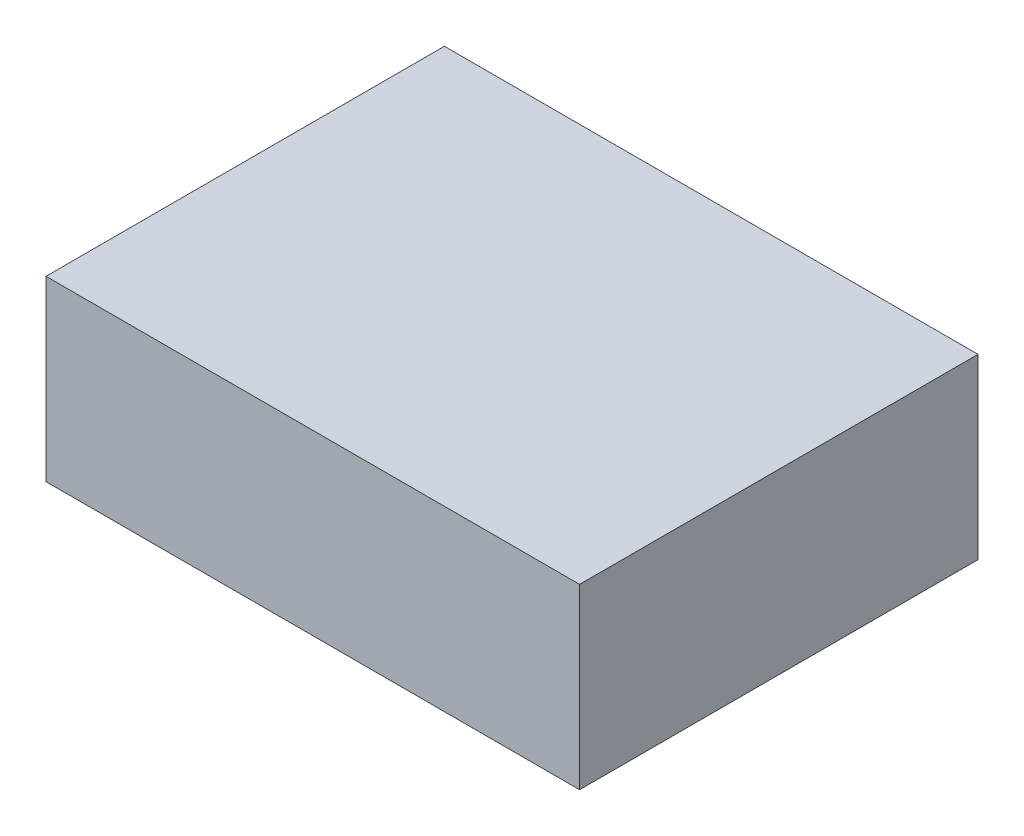
ISO-10303-21;
HEADER;
FILE_DESCRIPTION(('STEP AP214'),'2;1');
FILE_NAME('part.step','',(''),(''),'','','');
FILE_SCHEMA(('AUTOMOTIVE_DESIGN { 1 0 10303 214 1 1 1 1 }'));
ENDSEC;
DATA;
#1=APPLICATION_CONTEXT('core data for automotive mechanical design processes');
#2=APPLICATION_PROTOCOL_DEFINITION('international standard','automotive_design',2000,#1);
#3=PRODUCT_CONTEXT('',#1,'mechanical');
#4=PRODUCT('Part','Part','',(#3));
#5=PRODUCT_RELATED_PRODUCT_CATEGORY('part','',(#4));
#6=PRODUCT_DEFINITION_FORMATION('','',#4);
#7=PRODUCT_DEFINITION_CONTEXT('part definition',#1,'design');
#8=PRODUCT_DEFINITION('design','',#6,#7);
#9=PRODUCT_DEFINITION_SHAPE('','',#8);
#10=(LENGTH_UNIT() NAMED_UNIT(*) SI_UNIT(.MILLI.,.METRE.));
#11=(NAMED_UNIT(*) PLANE_ANGLE_UNIT() SI_UNIT($,.RADIAN.));
#12=(NAMED_UNIT(*) SI_UNIT($,.STERADIAN.) SOLID_ANGLE_UNIT());
#13=UNCERTAINTY_MEASURE_WITH_UNIT(LENGTH_MEASURE(1.E-05),#10,'distance_accuracy_value','');
#14=(GEOMETRIC_REPRESENTATION_CONTEXT(3) GLOBAL_UNCERTAINTY_ASSIGNED_CONTEXT((#13)) GLOBAL_UNIT_ASSIGNED_CONTEXT((#10,
#11,#12)) REPRESENTATION_CONTEXT('',''));
#15=CARTESIAN_POINT('',(0.,0.,0.));
#16=DIRECTION('',(0.,0.,1.));
#17=DIRECTION('',(1.,0.,0.));
#18=AXIS2_PLACEMENT_3D('',#15,#16,#17);
#19=CARTESIAN_POINT('',(0.,31.75,0.));
#20=DIRECTION('',(1.,0.,0.));
#21=DIRECTION('',(0.,0.,-1.));
#22=AXIS2_PLACEMENT_3D('',#19,#20,#21);
#23=PLANE('',#22);
#24=DIRECTION('',(0.,0.,1.));
#25=VECTOR('',#24,1.);
#26=CARTESIAN_POINT('',(0.,0.,0.));
#27=LINE('',#26,#25);
#28=CARTESIAN_POINT('',(0.,0.,-71.12));
#29=VERTEX_POINT('',#28);
#30=CARTESIAN_POINT('',(0.,0.,0.));
#31=VERTEX_POINT('',#30);
#32=EDGE_CURVE('E102',#29,#31,#27,.T.);
#33=ORIENTED_EDGE('',*,*,#32,.T.);
#34=DIRECTION('',(0.,-1.,0.));
#35=VECTOR('',#34,1.);
#36=CARTESIAN_POINT('',(0.,31.75,0.));
#37=LINE('',#36,#35);
#38=CARTESIAN_POINT('',(0.,31.75,0.));
#39=VERTEX_POINT('',#38);
#40=EDGE_CURVE('E11',#39,#31,#37,.T.);
#41=ORIENTED_EDGE('',*,*,#40,.F.);
#42=DIRECTION('',(0.,0.,1.));
#43=VECTOR('',#42,1.);
#44=CARTESIAN_POINT('',(0.,31.75,0.));
#45=LINE('',#44,#43);
#46=CARTESIAN_POINT('',(0.,31.75,-71.12));
#47=VERTEX_POINT('',#46);
#48=EDGE_CURVE('E90',#47,#39,#45,.T.);
#49=ORIENTED_EDGE('',*,*,#48,.F.);
#50=DIRECTION('',(0.,-1.,0.));
#51=VECTOR('',#50,1.);
#52=CARTESIAN_POINT('',(0.,31.75,-71.12));
#53=LINE('',#52,#51);
#54=EDGE_CURVE('E98',#47,#29,#53,.T.);
#55=ORIENTED_EDGE('',*,*,#54,.T.);
#56=EDGE_LOOP('',(#33,#41,#49,#55));
#57=FACE_BOUND('',#56,.T.);
#58=ADVANCED_FACE('F39',(#57),#23,.F.);
#59=CARTESIAN_POINT('',(0.,31.75,0.));
#60=DIRECTION('',(0.,0.,-1.));
#61=DIRECTION('',(-1.,0.,0.));
#62=AXIS2_PLACEMENT_3D('',#59,#60,#61);
#63=PLANE('',#62);
#64=DIRECTION('',(1.,0.,0.));
#65=VECTOR('',#64,1.);
#66=CARTESIAN_POINT('',(0.,0.,0.));
#67=LINE('',#66,#65);
#68=CARTESIAN_POINT('',(95.25,0.,0.));
#69=VERTEX_POINT('',#68);
#70=EDGE_CURVE('E94',#31,#69,#67,.T.);
#71=ORIENTED_EDGE('',*,*,#70,.T.);
#72=DIRECTION('',(0.,-1.,0.));
#73=VECTOR('',#72,1.);
#74=CARTESIAN_POINT('',(95.25,31.75,0.));
#75=LINE('',#74,#73);
#76=CARTESIAN_POINT('',(95.25,31.75,0.));
#77=VERTEX_POINT('',#76);
#78=EDGE_CURVE('E47',#77,#69,#75,.T.);
#79=ORIENTED_EDGE('',*,*,#78,.F.);
#80=DIRECTION('',(1.,0.,0.));
#81=VECTOR('',#80,1.);
#82=CARTESIAN_POINT('',(0.,31.75,0.));
#83=LINE('',#82,#81);
#84=EDGE_CURVE('E85',#39,#77,#83,.T.);
#85=ORIENTED_EDGE('',*,*,#84,.F.);
#86=ORIENTED_EDGE('',*,*,#40,.T.);
#87=EDGE_LOOP('',(#71,#79,#85,#86));
#88=FACE_BOUND('',#87,.T.);
#89=ADVANCED_FACE('F93',(#88),#63,.F.);
#90=CARTESIAN_POINT('',(95.25,31.75,0.));
#91=DIRECTION('',(-1.,0.,0.));
#92=DIRECTION('',(0.,0.,1.));
#93=AXIS2_PLACEMENT_3D('',#90,#91,#92);
#94=PLANE('',#93);
#95=DIRECTION('',(0.,0.,-1.));
#96=VECTOR('',#95,1.);
#97=CARTESIAN_POINT('',(95.25,0.,0.));
#98=LINE('',#97,#96);
#99=CARTESIAN_POINT('',(95.25,0.,-71.12));
#100=VERTEX_POINT('',#99);
#101=EDGE_CURVE('E72',#69,#100,#98,.T.);
#102=ORIENTED_EDGE('',*,*,#101,.T.);
#103=DIRECTION('',(0.,-1.,0.));
#104=VECTOR('',#103,1.);
#105=CARTESIAN_POINT('',(95.25,31.75,-71.12));
#106=LINE('',#105,#104);
#107=CARTESIAN_POINT('',(95.25,31.75,-71.12));
#108=VERTEX_POINT('',#107);
#109=EDGE_CURVE('E95',#108,#100,#106,.T.);
#110=ORIENTED_EDGE('',*,*,#109,.F.);
#111=DIRECTION('',(0.,0.,-1.));
#112=VECTOR('',#111,1.);
#113=CARTESIAN_POINT('',(95.25,31.75,0.));
#114=LINE('',#113,#112);
#115=EDGE_CURVE('E88',#77,#108,#114,.T.);
#116=ORIENTED_EDGE('',*,*,#115,.F.);
#117=ORIENTED_EDGE('',*,*,#78,.T.);
#118=EDGE_LOOP('',(#102,#110,#116,#117));
#119=FACE_BOUND('',#118,.T.);
#120=ADVANCED_FACE('F96',(#119),#94,.F.);
#121=CARTESIAN_POINT('',(0.,31.75,-71.12));
#122=DIRECTION('',(0.,0.,1.));
#123=DIRECTION('',(1.,0.,0.));
#124=AXIS2_PLACEMENT_3D('',#121,#122,#123);
#125=PLANE('',#124);
#126=DIRECTION('',(-1.,0.,0.));
#127=VECTOR('',#126,1.);
#128=CARTESIAN_POINT('',(0.,0.,-71.12));
#129=LINE('',#128,#127);
#130=EDGE_CURVE('E78',#100,#29,#129,.T.);
#131=ORIENTED_EDGE('',*,*,#130,.T.);
#132=ORIENTED_EDGE('',*,*,#54,.F.);
#133=DIRECTION('',(-1.,0.,0.));
#134=VECTOR('',#133,1.);
#135=CARTESIAN_POINT('',(0.,31.75,-71.12));
#136=LINE('',#135,#134);
#137=EDGE_CURVE('E55',#108,#47,#136,.T.);
#138=ORIENTED_EDGE('',*,*,#137,.F.);
#139=ORIENTED_EDGE('',*,*,#109,.T.);
#140=EDGE_LOOP('',(#131,#132,#138,#139));
#141=FACE_BOUND('',#140,.T.);
#142=ADVANCED_FACE('F109',(#141),#125,.F.);
#143=CARTESIAN_POINT('',(0.,31.75,0.));
#144=DIRECTION('',(0.,-1.,0.));
#145=DIRECTION('',(0.,0.,-1.));
#146=AXIS2_PLACEMENT_3D('',#143,#144,#145);
#147=PLANE('',#146);
#148=ORIENTED_EDGE('',*,*,#48,.T.);
#149=ORIENTED_EDGE('',*,*,#84,.T.);
#150=ORIENTED_EDGE('',*,*,#115,.T.);
#151=ORIENTED_EDGE('',*,*,#137,.T.);
#152=EDGE_LOOP('',(#148,#149,#150,#151));
#153=FACE_BOUND('',#152,.T.);
#154=ADVANCED_FACE('F86',(#153),#147,.F.);
#155=CARTESIAN_POINT('',(0.,0.,0.));
#156=DIRECTION('',(0.,-1.,0.));
#157=DIRECTION('',(0.,0.,-1.));
#158=AXIS2_PLACEMENT_3D('',#155,#156,#157);
#159=PLANE('',#158);
#160=ORIENTED_EDGE('',*,*,#32,.F.);
#161=ORIENTED_EDGE('',*,*,#130,.F.);
#162=ORIENTED_EDGE('',*,*,#101,.F.);
#163=ORIENTED_EDGE('',*,*,#70,.F.);
#164=EDGE_LOOP('',(#160,#161,#162,#163));
#165=FACE_BOUND('',#164,.T.);
#166=ADVANCED_FACE('F112',(#165),#159,.T.);
#167=CLOSED_SHELL('',(#58,#89,#120,#142,#154,#166));
#168=MANIFOLD_SOLID_BREP('B2',#167);
#169=ADVANCED_BREP_SHAPE_REPRESENTATION('',(#18,#168),#14);
#170=SHAPE_DEFINITION_REPRESENTATION(#9,#169);
ENDSEC;
END-ISO-10303-21;
